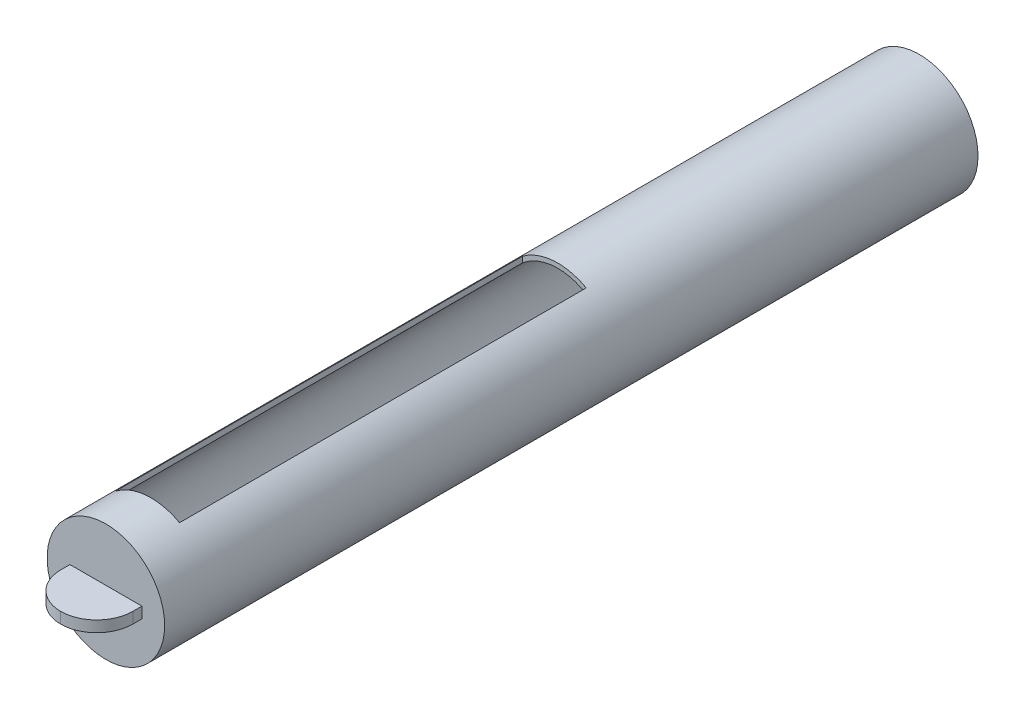
ISO-10303-21;
HEADER;
FILE_DESCRIPTION(('STEP AP214'),'2;1');
FILE_NAME('part.step','',(''),(''),'','','');
FILE_SCHEMA(('AUTOMOTIVE_DESIGN { 1 0 10303 214 1 1 1 1 }'));
ENDSEC;
DATA;
#1=APPLICATION_CONTEXT('core data for automotive mechanical design processes');
#2=APPLICATION_PROTOCOL_DEFINITION('international standard','automotive_design',2000,#1);
#3=PRODUCT_CONTEXT('',#1,'mechanical');
#4=PRODUCT('Part','Part','',(#3));
#5=PRODUCT_RELATED_PRODUCT_CATEGORY('part','',(#4));
#6=PRODUCT_DEFINITION_FORMATION('','',#4);
#7=PRODUCT_DEFINITION_CONTEXT('part definition',#1,'design');
#8=PRODUCT_DEFINITION('design','',#6,#7);
#9=PRODUCT_DEFINITION_SHAPE('','',#8);
#10=(LENGTH_UNIT() NAMED_UNIT(*) SI_UNIT(.MILLI.,.METRE.));
#11=(NAMED_UNIT(*) PLANE_ANGLE_UNIT() SI_UNIT($,.RADIAN.));
#12=(NAMED_UNIT(*) SI_UNIT($,.STERADIAN.) SOLID_ANGLE_UNIT());
#13=UNCERTAINTY_MEASURE_WITH_UNIT(LENGTH_MEASURE(1.E-05),#10,'distance_accuracy_value','');
#14=(GEOMETRIC_REPRESENTATION_CONTEXT(3) GLOBAL_UNCERTAINTY_ASSIGNED_CONTEXT((#13)) GLOBAL_UNIT_ASSIGNED_CONTEXT((#10,
#11,#12)) REPRESENTATION_CONTEXT('',''));
#15=CARTESIAN_POINT('',(0.,0.,0.));
#16=DIRECTION('',(0.,0.,1.));
#17=DIRECTION('',(1.,0.,0.));
#18=AXIS2_PLACEMENT_3D('',#15,#16,#17);
#19=CARTESIAN_POINT('',(0.,-25.4,12.7));
#20=DIRECTION('',(0.,0.,1.));
#21=DIRECTION('',(1.,0.,0.));
#22=AXIS2_PLACEMENT_3D('',#19,#20,#21);
#23=PLANE('',#22);
#24=CARTESIAN_POINT('',(0.,-25.4,12.7));
#25=DIRECTION('',(0.,0.,1.));
#26=DIRECTION('',(1.,0.,0.));
#27=AXIS2_PLACEMENT_3D('',#24,#25,#26);
#28=CIRCLE('',#27,16.51);
#29=CARTESIAN_POINT('',(16.51,-25.4,12.7));
#30=VERTEX_POINT('',#29);
#31=EDGE_CURVE('E152',#30,#30,#28,.T.);
#32=ORIENTED_EDGE('',*,*,#31,.T.);
#33=EDGE_LOOP('',(#32));
#34=FACE_BOUND('',#33,.T.);
#35=DIRECTION('',(1.,0.,0.));
#36=VECTOR('',#35,1.);
#37=CARTESIAN_POINT('',(10.1095926051221,-26.9549060379917,12.7));
#38=LINE('',#37,#36);
#39=CARTESIAN_POINT('',(-10.1095926051221,-26.9549060379917,12.7));
#40=VERTEX_POINT('',#39);
#41=CARTESIAN_POINT('',(10.1095926051221,-26.9549060379917,12.7));
#42=VERTEX_POINT('',#41);
#43=EDGE_CURVE('E104',#40,#42,#38,.T.);
#44=ORIENTED_EDGE('',*,*,#43,.F.);
#45=DIRECTION('',(0.,-1.,0.));
#46=VECTOR('',#45,1.);
#47=CARTESIAN_POINT('',(-10.1095926051221,-23.8450939620084,12.7));
#48=LINE('',#47,#46);
#49=CARTESIAN_POINT('',(-10.1095926051221,-23.8450939620084,12.7));
#50=VERTEX_POINT('',#49);
#51=EDGE_CURVE('E112',#50,#40,#48,.T.);
#52=ORIENTED_EDGE('',*,*,#51,.F.);
#53=DIRECTION('',(-1.,0.,0.));
#54=VECTOR('',#53,1.);
#55=CARTESIAN_POINT('',(10.1095926051221,-23.8450939620084,12.7));
#56=LINE('',#55,#54);
#57=CARTESIAN_POINT('',(10.1095926051221,-23.8450939620084,12.7));
#58=VERTEX_POINT('',#57);
#59=EDGE_CURVE('E123',#58,#50,#56,.T.);
#60=ORIENTED_EDGE('',*,*,#59,.F.);
#61=DIRECTION('',(0.,1.,0.));
#62=VECTOR('',#61,1.);
#63=CARTESIAN_POINT('',(10.1095926051221,-23.8450939620084,12.7));
#64=LINE('',#63,#62);
#65=EDGE_CURVE('E121',#42,#58,#64,.T.);
#66=ORIENTED_EDGE('',*,*,#65,.F.);
#67=EDGE_LOOP('',(#44,#52,#60,#66));
#68=FACE_BOUND('',#67,.T.);
#69=ADVANCED_FACE('F34',(#34,#68),#23,.T.);
#70=CARTESIAN_POINT('',(0.,-25.4,-215.9));
#71=DIRECTION('',(0.,0.,1.));
#72=DIRECTION('',(1.,0.,0.));
#73=AXIS2_PLACEMENT_3D('',#70,#71,#72);
#74=CYLINDRICAL_SURFACE('',#73,16.51);
#75=CARTESIAN_POINT('',(0.,-25.4,-114.3));
#76=DIRECTION('',(0.,0.,-1.));
#77=DIRECTION('',(-1.,0.,0.));
#78=AXIS2_PLACEMENT_3D('',#75,#76,#77);
#79=CIRCLE('',#78,16.51);
#80=CARTESIAN_POINT('',(7.99494760707281,-10.9549000432617,-114.3));
#81=VERTEX_POINT('',#80);
#82=CARTESIAN_POINT('',(-9.94926813324616,-12.2245621092591,-114.3));
#83=VERTEX_POINT('',#82);
#84=EDGE_CURVE('E145',#81,#83,#79,.F.);
#85=ORIENTED_EDGE('',*,*,#84,.F.);
#86=DIRECTION('',(0.,0.,1.));
#87=VECTOR('',#86,1.);
#88=CARTESIAN_POINT('',(7.99494760707281,-10.9549000432617,-215.9));
#89=LINE('',#88,#87);
#90=CARTESIAN_POINT('',(7.99494760707281,-10.9549000432617,0.));
#91=VERTEX_POINT('',#90);
#92=EDGE_CURVE('E150',#91,#81,#89,.F.);
#93=ORIENTED_EDGE('',*,*,#92,.F.);
#94=CARTESIAN_POINT('',(0.,-25.4,0.));
#95=DIRECTION('',(0.,0.,-1.));
#96=DIRECTION('',(-1.,0.,0.));
#97=AXIS2_PLACEMENT_3D('',#94,#95,#96);
#98=CIRCLE('',#97,16.51);
#99=CARTESIAN_POINT('',(-9.94926813324616,-12.2245621092591,0.));
#100=VERTEX_POINT('',#99);
#101=EDGE_CURVE('E138',#91,#100,#98,.F.);
#102=ORIENTED_EDGE('',*,*,#101,.T.);
#103=DIRECTION('',(0.,0.,1.));
#104=VECTOR('',#103,1.);
#105=CARTESIAN_POINT('',(-9.94926813324616,-12.2245621092591,-215.9));
#106=LINE('',#105,#104);
#107=EDGE_CURVE('E147',#83,#100,#106,.T.);
#108=ORIENTED_EDGE('',*,*,#107,.F.);
#109=EDGE_LOOP('',(#85,#93,#102,#108));
#110=FACE_BOUND('',#109,.T.);
#111=CARTESIAN_POINT('',(0.,-25.4,-215.9));
#112=DIRECTION('',(0.,0.,1.));
#113=DIRECTION('',(1.,0.,0.));
#114=AXIS2_PLACEMENT_3D('',#111,#112,#113);
#115=CIRCLE('',#114,16.51);
#116=CARTESIAN_POINT('',(16.51,-25.4,-215.9));
#117=VERTEX_POINT('',#116);
#118=EDGE_CURVE('E155',#117,#117,#115,.T.);
#119=ORIENTED_EDGE('',*,*,#118,.T.);
#120=EDGE_LOOP('',(#119));
#121=FACE_BOUND('',#120,.T.);
#122=ORIENTED_EDGE('',*,*,#31,.F.);
#123=EDGE_LOOP('',(#122));
#124=FACE_BOUND('',#123,.T.);
#125=ADVANCED_FACE('F204',(#110,#121,#124),#74,.T.);
#126=CARTESIAN_POINT('',(0.,-25.4,-215.9));
#127=DIRECTION('',(0.,0.,1.));
#128=DIRECTION('',(1.,0.,0.));
#129=AXIS2_PLACEMENT_3D('',#126,#127,#128);
#130=PLANE('',#129);
#131=ORIENTED_EDGE('',*,*,#118,.F.);
#132=EDGE_LOOP('',(#131));
#133=FACE_BOUND('',#132,.T.);
#134=ADVANCED_FACE('F210',(#133),#130,.F.);
#135=CARTESIAN_POINT('',(7.99494760707281,-4.21338884125637,-114.3));
#136=DIRECTION('',(1.,0.,0.));
#137=DIRECTION('',(0.,0.,-1.));
#138=AXIS2_PLACEMENT_3D('',#135,#136,#137);
#139=PLANE('',#138);
#140=ORIENTED_EDGE('',*,*,#92,.T.);
#141=DIRECTION('',(0.,1.,0.));
#142=VECTOR('',#141,1.);
#143=CARTESIAN_POINT('',(7.99494760707281,-4.21338884125637,-114.3));
#144=LINE('',#143,#142);
#145=CARTESIAN_POINT('',(7.99494760707281,-12.4254706150797,-114.3));
#146=VERTEX_POINT('',#145);
#147=EDGE_CURVE('E131',#146,#81,#144,.T.);
#148=ORIENTED_EDGE('',*,*,#147,.F.);
#149=DIRECTION('',(0.,0.,1.));
#150=VECTOR('',#149,1.);
#151=CARTESIAN_POINT('',(7.99494760707281,-12.4254706150797,-215.9));
#152=LINE('',#151,#150);
#153=CARTESIAN_POINT('',(7.99494760707281,-12.4254706150797,0.));
#154=VERTEX_POINT('',#153);
#155=EDGE_CURVE('E169',#154,#146,#152,.F.);
#156=ORIENTED_EDGE('',*,*,#155,.F.);
#157=DIRECTION('',(0.,1.,0.));
#158=VECTOR('',#157,1.);
#159=CARTESIAN_POINT('',(7.99494760707281,-4.21338884125637,0.));
#160=LINE('',#159,#158);
#161=EDGE_CURVE('E108',#154,#91,#160,.T.);
#162=ORIENTED_EDGE('',*,*,#161,.T.);
#163=EDGE_LOOP('',(#140,#148,#156,#162));
#164=FACE_BOUND('',#163,.T.);
#165=ADVANCED_FACE('F215',(#164),#139,.F.);
#166=CARTESIAN_POINT('',(-9.94926813324616,-4.21338884125637,-114.3));
#167=DIRECTION('',(-1.,0.,0.));
#168=DIRECTION('',(0.,0.,1.));
#169=AXIS2_PLACEMENT_3D('',#166,#167,#168);
#170=PLANE('',#169);
#171=ORIENTED_EDGE('',*,*,#107,.T.);
#172=DIRECTION('',(0.,-1.,0.));
#173=VECTOR('',#172,1.);
#174=CARTESIAN_POINT('',(-9.94926813324616,-4.21338884125637,0.));
#175=LINE('',#174,#173);
#176=CARTESIAN_POINT('',(-9.94926813324616,-13.8557519251892,0.));
#177=VERTEX_POINT('',#176);
#178=EDGE_CURVE('E135',#100,#177,#175,.T.);
#179=ORIENTED_EDGE('',*,*,#178,.T.);
#180=DIRECTION('',(0.,0.,1.));
#181=VECTOR('',#180,1.);
#182=CARTESIAN_POINT('',(-9.94926813324616,-13.8557519251892,-215.9));
#183=LINE('',#182,#181);
#184=CARTESIAN_POINT('',(-9.94926813324616,-13.8557519251892,-114.3));
#185=VERTEX_POINT('',#184);
#186=EDGE_CURVE('E166',#185,#177,#183,.T.);
#187=ORIENTED_EDGE('',*,*,#186,.F.);
#188=DIRECTION('',(0.,-1.,0.));
#189=VECTOR('',#188,1.);
#190=CARTESIAN_POINT('',(-9.94926813324616,-4.21338884125637,-114.3));
#191=LINE('',#190,#189);
#192=EDGE_CURVE('E134',#83,#185,#191,.T.);
#193=ORIENTED_EDGE('',*,*,#192,.F.);
#194=EDGE_LOOP('',(#171,#179,#187,#193));
#195=FACE_BOUND('',#194,.T.);
#196=ADVANCED_FACE('F297',(#195),#170,.F.);
#197=CARTESIAN_POINT('',(0.,0.,-114.3));
#198=DIRECTION('',(0.,0.,-1.));
#199=DIRECTION('',(-1.,0.,0.));
#200=AXIS2_PLACEMENT_3D('',#197,#198,#199);
#201=PLANE('',#200);
#202=ORIENTED_EDGE('',*,*,#84,.T.);
#203=ORIENTED_EDGE('',*,*,#192,.T.);
#204=CARTESIAN_POINT('',(0.,-25.4,-114.3));
#205=DIRECTION('',(0.,0.,-1.));
#206=DIRECTION('',(-1.,0.,0.));
#207=AXIS2_PLACEMENT_3D('',#204,#205,#206);
#208=CIRCLE('',#207,15.24);
#209=EDGE_CURVE('E172',#146,#185,#208,.F.);
#210=ORIENTED_EDGE('',*,*,#209,.F.);
#211=ORIENTED_EDGE('',*,*,#147,.T.);
#212=EDGE_LOOP('',(#202,#203,#210,#211));
#213=FACE_BOUND('',#212,.T.);
#214=ADVANCED_FACE('F287',(#213),#201,.F.);
#215=CARTESIAN_POINT('',(0.,0.,0.));
#216=DIRECTION('',(0.,0.,-1.));
#217=DIRECTION('',(-1.,0.,0.));
#218=AXIS2_PLACEMENT_3D('',#215,#216,#217);
#219=PLANE('',#218);
#220=ORIENTED_EDGE('',*,*,#161,.F.);
#221=CARTESIAN_POINT('',(0.,-25.4,0.));
#222=DIRECTION('',(0.,0.,-1.));
#223=DIRECTION('',(-1.,0.,0.));
#224=AXIS2_PLACEMENT_3D('',#221,#222,#223);
#225=CIRCLE('',#224,15.24);
#226=EDGE_CURVE('E162',#154,#177,#225,.F.);
#227=ORIENTED_EDGE('',*,*,#226,.T.);
#228=ORIENTED_EDGE('',*,*,#178,.F.);
#229=ORIENTED_EDGE('',*,*,#101,.F.);
#230=EDGE_LOOP('',(#220,#227,#228,#229));
#231=FACE_BOUND('',#230,.T.);
#232=ADVANCED_FACE('F224',(#231),#219,.T.);
#233=CARTESIAN_POINT('',(0.,-25.4,-215.9));
#234=DIRECTION('',(0.,0.,1.));
#235=DIRECTION('',(1.,0.,0.));
#236=AXIS2_PLACEMENT_3D('',#233,#234,#235);
#237=CYLINDRICAL_SURFACE('',#236,15.24);
#238=ORIENTED_EDGE('',*,*,#155,.T.);
#239=ORIENTED_EDGE('',*,*,#209,.T.);
#240=ORIENTED_EDGE('',*,*,#186,.T.);
#241=ORIENTED_EDGE('',*,*,#226,.F.);
#242=EDGE_LOOP('',(#238,#239,#240,#241));
#243=FACE_BOUND('',#242,.T.);
#244=CARTESIAN_POINT('',(0.,-25.4,-214.63));
#245=DIRECTION('',(0.,0.,1.));
#246=DIRECTION('',(1.,0.,0.));
#247=AXIS2_PLACEMENT_3D('',#244,#245,#246);
#248=CIRCLE('',#247,15.24);
#249=CARTESIAN_POINT('',(15.24,-25.4,-214.63));
#250=VERTEX_POINT('',#249);
#251=EDGE_CURVE('E158',#250,#250,#248,.T.);
#252=ORIENTED_EDGE('',*,*,#251,.F.);
#253=EDGE_LOOP('',(#252));
#254=FACE_BOUND('',#253,.T.);
#255=CARTESIAN_POINT('',(0.,-25.4,11.43));
#256=DIRECTION('',(0.,0.,1.));
#257=DIRECTION('',(1.,0.,0.));
#258=AXIS2_PLACEMENT_3D('',#255,#256,#257);
#259=CIRCLE('',#258,15.24);
#260=CARTESIAN_POINT('',(15.24,-25.4,11.43));
#261=VERTEX_POINT('',#260);
#262=EDGE_CURVE('E159',#261,#261,#259,.T.);
#263=ORIENTED_EDGE('',*,*,#262,.T.);
#264=EDGE_LOOP('',(#263));
#265=FACE_BOUND('',#264,.T.);
#266=ADVANCED_FACE('F220',(#243,#254,#265),#237,.F.);
#267=CARTESIAN_POINT('',(0.,-25.4,-214.63));
#268=DIRECTION('',(0.,0.,1.));
#269=DIRECTION('',(1.,0.,0.));
#270=AXIS2_PLACEMENT_3D('',#267,#268,#269);
#271=PLANE('',#270);
#272=ORIENTED_EDGE('',*,*,#251,.T.);
#273=EDGE_LOOP('',(#272));
#274=FACE_BOUND('',#273,.T.);
#275=ADVANCED_FACE('F223',(#274),#271,.T.);
#276=CARTESIAN_POINT('',(0.,-25.4,11.43));
#277=DIRECTION('',(0.,0.,1.));
#278=DIRECTION('',(1.,0.,0.));
#279=AXIS2_PLACEMENT_3D('',#276,#277,#278);
#280=PLANE('',#279);
#281=ORIENTED_EDGE('',*,*,#262,.F.);
#282=EDGE_LOOP('',(#281));
#283=FACE_BOUND('',#282,.T.);
#284=ADVANCED_FACE('F228',(#283),#280,.F.);
#285=CARTESIAN_POINT('',(-10.1095926051221,-23.8450939620084,25.4));
#286=DIRECTION('',(1.,0.,0.));
#287=DIRECTION('',(0.,0.,-1.));
#288=AXIS2_PLACEMENT_3D('',#285,#286,#287);
#289=PLANE('',#288);
#290=DIRECTION('',(0.,0.,-1.));
#291=VECTOR('',#290,1.);
#292=CARTESIAN_POINT('',(-10.1095926051221,-26.9549060379917,25.4));
#293=LINE('',#292,#291);
#294=CARTESIAN_POINT('',(-10.1095926051221,-26.9549060379917,15.24));
#295=VERTEX_POINT('',#294);
#296=EDGE_CURVE('E100',#295,#40,#293,.T.);
#297=ORIENTED_EDGE('',*,*,#296,.F.);
#298=DIRECTION('',(0.,-1.,0.));
#299=VECTOR('',#298,1.);
#300=CARTESIAN_POINT('',(-10.1095926051221,-23.8450939620084,15.24));
#301=LINE('',#300,#299);
#302=CARTESIAN_POINT('',(-10.1095926051221,-23.8450939620084,15.24));
#303=VERTEX_POINT('',#302);
#304=EDGE_CURVE('E11',#295,#303,#301,.F.);
#305=ORIENTED_EDGE('',*,*,#304,.T.);
#306=DIRECTION('',(0.,0.,-1.));
#307=VECTOR('',#306,1.);
#308=CARTESIAN_POINT('',(-10.1095926051221,-23.8450939620084,25.4));
#309=LINE('',#308,#307);
#310=EDGE_CURVE('E115',#303,#50,#309,.T.);
#311=ORIENTED_EDGE('',*,*,#310,.T.);
#312=ORIENTED_EDGE('',*,*,#51,.T.);
#313=EDGE_LOOP('',(#297,#305,#311,#312));
#314=FACE_BOUND('',#313,.T.);
#315=ADVANCED_FACE('F113',(#314),#289,.F.);
#316=CARTESIAN_POINT('',(10.1095926051221,-26.9549060379917,25.4));
#317=DIRECTION('',(0.,1.,0.));
#318=DIRECTION('',(0.,0.,1.));
#319=AXIS2_PLACEMENT_3D('',#316,#317,#318);
#320=PLANE('',#319);
#321=DIRECTION('',(0.,0.,-1.));
#322=VECTOR('',#321,1.);
#323=CARTESIAN_POINT('',(10.1095926051221,-26.9549060379917,25.4));
#324=LINE('',#323,#322);
#325=CARTESIAN_POINT('',(10.1095926051221,-26.9549060379917,15.24));
#326=VERTEX_POINT('',#325);
#327=EDGE_CURVE('E109',#326,#42,#324,.T.);
#328=ORIENTED_EDGE('',*,*,#327,.F.);
#329=CARTESIAN_POINT('',(-0.0504073948779018,-26.9549060379917,15.24));
#330=DIRECTION('',(0.,1.,0.));
#331=DIRECTION('',(0.,0.,1.));
#332=AXIS2_PLACEMENT_3D('',#329,#330,#331);
#333=CIRCLE('',#332,10.16);
#334=CARTESIAN_POINT('',(0.,-26.9549060379917,25.3998749546705));
#335=VERTEX_POINT('',#334);
#336=EDGE_CURVE('E43',#326,#335,#333,.F.);
#337=ORIENTED_EDGE('',*,*,#336,.T.);
#338=CARTESIAN_POINT('',(0.0504073948779018,-26.9549060379917,15.24));
#339=DIRECTION('',(0.,1.,0.));
#340=DIRECTION('',(0.,0.,1.));
#341=AXIS2_PLACEMENT_3D('',#338,#339,#340);
#342=CIRCLE('',#341,10.16);
#343=EDGE_CURVE('E53',#335,#295,#342,.F.);
#344=ORIENTED_EDGE('',*,*,#343,.T.);
#345=ORIENTED_EDGE('',*,*,#296,.T.);
#346=ORIENTED_EDGE('',*,*,#43,.T.);
#347=EDGE_LOOP('',(#328,#337,#344,#345,#346));
#348=FACE_BOUND('',#347,.T.);
#349=ADVANCED_FACE('F102',(#348),#320,.F.);
#350=CARTESIAN_POINT('',(10.1095926051221,-23.8450939620084,25.4));
#351=DIRECTION('',(-1.,0.,0.));
#352=DIRECTION('',(0.,0.,1.));
#353=AXIS2_PLACEMENT_3D('',#350,#351,#352);
#354=PLANE('',#353);
#355=DIRECTION('',(0.,0.,-1.));
#356=VECTOR('',#355,1.);
#357=CARTESIAN_POINT('',(10.1095926051221,-23.8450939620084,25.4));
#358=LINE('',#357,#356);
#359=CARTESIAN_POINT('',(10.1095926051221,-23.8450939620084,15.24));
#360=VERTEX_POINT('',#359);
#361=EDGE_CURVE('E128',#360,#58,#358,.T.);
#362=ORIENTED_EDGE('',*,*,#361,.F.);
#363=DIRECTION('',(0.,1.,0.));
#364=VECTOR('',#363,1.);
#365=CARTESIAN_POINT('',(10.1095926051221,-23.8450939620084,15.24));
#366=LINE('',#365,#364);
#367=EDGE_CURVE('E179',#360,#326,#366,.F.);
#368=ORIENTED_EDGE('',*,*,#367,.T.);
#369=ORIENTED_EDGE('',*,*,#327,.T.);
#370=ORIENTED_EDGE('',*,*,#65,.T.);
#371=EDGE_LOOP('',(#362,#368,#369,#370));
#372=FACE_BOUND('',#371,.T.);
#373=ADVANCED_FACE('F186',(#372),#354,.F.);
#374=CARTESIAN_POINT('',(10.1095926051221,-23.8450939620084,25.4));
#375=DIRECTION('',(0.,-1.,0.));
#376=DIRECTION('',(0.,0.,-1.));
#377=AXIS2_PLACEMENT_3D('',#374,#375,#376);
#378=PLANE('',#377);
#379=CARTESIAN_POINT('',(0.0504073948779018,-23.8450939620084,15.24));
#380=DIRECTION('',(0.,-1.,0.));
#381=DIRECTION('',(0.,0.,-1.));
#382=AXIS2_PLACEMENT_3D('',#379,#380,#381);
#383=CIRCLE('',#382,10.16);
#384=CARTESIAN_POINT('',(0.,-23.8450939620084,25.3998749546705));
#385=VERTEX_POINT('',#384);
#386=EDGE_CURVE('E175',#303,#385,#383,.F.);
#387=ORIENTED_EDGE('',*,*,#386,.T.);
#388=CARTESIAN_POINT('',(-0.0504073948779018,-23.8450939620084,15.24));
#389=DIRECTION('',(0.,-1.,0.));
#390=DIRECTION('',(0.,0.,-1.));
#391=AXIS2_PLACEMENT_3D('',#388,#389,#390);
#392=CIRCLE('',#391,10.16);
#393=EDGE_CURVE('E177',#385,#360,#392,.F.);
#394=ORIENTED_EDGE('',*,*,#393,.T.);
#395=ORIENTED_EDGE('',*,*,#361,.T.);
#396=ORIENTED_EDGE('',*,*,#59,.T.);
#397=ORIENTED_EDGE('',*,*,#310,.F.);
#398=EDGE_LOOP('',(#387,#394,#395,#396,#397));
#399=FACE_BOUND('',#398,.T.);
#400=ADVANCED_FACE('F195',(#399),#378,.F.);
#401=CARTESIAN_POINT('',(0.0504073948779018,0.,15.24));
#402=DIRECTION('',(0.,-1.,0.));
#403=DIRECTION('',(0.,0.,-1.));
#404=AXIS2_PLACEMENT_3D('',#401,#402,#403);
#405=CYLINDRICAL_SURFACE('',#404,10.16);
#406=ORIENTED_EDGE('',*,*,#304,.F.);
#407=ORIENTED_EDGE('',*,*,#343,.F.);
#408=DIRECTION('',(0.,-1.,0.));
#409=VECTOR('',#408,1.);
#410=CARTESIAN_POINT('',(0.,-25.4,25.3998749546705));
#411=LINE('',#410,#409);
#412=EDGE_CURVE('E38',#385,#335,#411,.T.);
#413=ORIENTED_EDGE('',*,*,#412,.F.);
#414=ORIENTED_EDGE('',*,*,#386,.F.);
#415=EDGE_LOOP('',(#406,#407,#413,#414));
#416=FACE_BOUND('',#415,.T.);
#417=ADVANCED_FACE('F36',(#416),#405,.T.);
#418=CARTESIAN_POINT('',(-0.0504073948779018,0.,15.24));
#419=DIRECTION('',(0.,1.,0.));
#420=DIRECTION('',(0.,0.,1.));
#421=AXIS2_PLACEMENT_3D('',#418,#419,#420);
#422=CYLINDRICAL_SURFACE('',#421,10.16);
#423=ORIENTED_EDGE('',*,*,#336,.F.);
#424=ORIENTED_EDGE('',*,*,#367,.F.);
#425=ORIENTED_EDGE('',*,*,#393,.F.);
#426=ORIENTED_EDGE('',*,*,#412,.T.);
#427=EDGE_LOOP('',(#423,#424,#425,#426));
#428=FACE_BOUND('',#427,.T.);
#429=ADVANCED_FACE('F189',(#428),#422,.T.);
#430=CLOSED_SHELL('',(#69,#125,#134,#165,#196,#214,#232,#266,#275,#284,#315,#349,#373,#400,#417,#429));
#431=MANIFOLD_SOLID_BREP('B2',#430);
#432=ADVANCED_BREP_SHAPE_REPRESENTATION('',(#18,#431),#14);
#433=SHAPE_DEFINITION_REPRESENTATION(#9,#432);
ENDSEC;
END-ISO-10303-21;
